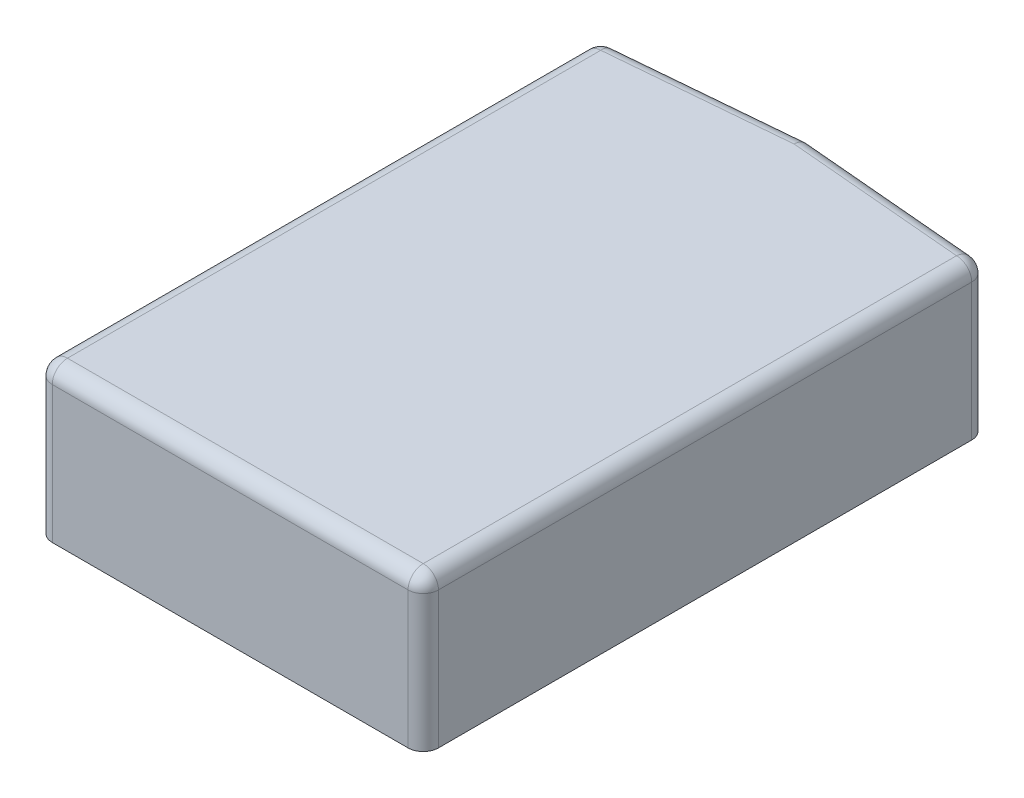
ISO-10303-21;
HEADER;
FILE_DESCRIPTION(('STEP AP214'),'2;1');
FILE_NAME('part.step','',(''),(''),'','','');
FILE_SCHEMA(('AUTOMOTIVE_DESIGN { 1 0 10303 214 1 1 1 1 }'));
ENDSEC;
DATA;
#1=APPLICATION_CONTEXT('core data for automotive mechanical design processes');
#2=APPLICATION_PROTOCOL_DEFINITION('international standard','automotive_design',2000,#1);
#3=PRODUCT_CONTEXT('',#1,'mechanical');
#4=PRODUCT('Part','Part','',(#3));
#5=PRODUCT_RELATED_PRODUCT_CATEGORY('part','',(#4));
#6=PRODUCT_DEFINITION_FORMATION('','',#4);
#7=PRODUCT_DEFINITION_CONTEXT('part definition',#1,'design');
#8=PRODUCT_DEFINITION('design','',#6,#7);
#9=PRODUCT_DEFINITION_SHAPE('','',#8);
#10=(LENGTH_UNIT() NAMED_UNIT(*) SI_UNIT(.MILLI.,.METRE.));
#11=(NAMED_UNIT(*) PLANE_ANGLE_UNIT() SI_UNIT($,.RADIAN.));
#12=(NAMED_UNIT(*) SI_UNIT($,.STERADIAN.) SOLID_ANGLE_UNIT());
#13=UNCERTAINTY_MEASURE_WITH_UNIT(LENGTH_MEASURE(1.E-05),#10,'distance_accuracy_value','');
#14=(GEOMETRIC_REPRESENTATION_CONTEXT(3) GLOBAL_UNCERTAINTY_ASSIGNED_CONTEXT((#13)) GLOBAL_UNIT_ASSIGNED_CONTEXT((#10,
#11,#12)) REPRESENTATION_CONTEXT('',''));
#15=CARTESIAN_POINT('',(0.,0.,0.));
#16=DIRECTION('',(0.,0.,1.));
#17=DIRECTION('',(1.,0.,0.));
#18=AXIS2_PLACEMENT_3D('',#15,#16,#17);
#19=CARTESIAN_POINT('',(-25.4,20.,38.1));
#20=DIRECTION('',(-1.,0.,0.));
#21=DIRECTION('',(0.,0.,1.));
#22=AXIS2_PLACEMENT_3D('',#19,#20,#21);
#23=PLANE('',#22);
#24=DIRECTION('',(0.,0.,-1.));
#25=VECTOR('',#24,1.);
#26=CARTESIAN_POINT('',(-25.4,18.,-35.8777879464415));
#27=LINE('',#26,#25);
#28=CARTESIAN_POINT('',(-25.4,18.,36.1));
#29=VERTEX_POINT('',#28);
#30=CARTESIAN_POINT('',(-25.4,18.,-34.0451255984067));
#31=VERTEX_POINT('',#30);
#32=EDGE_CURVE('E181',#29,#31,#27,.T.);
#33=ORIENTED_EDGE('',*,*,#32,.T.);
#34=DIRECTION('',(0.,1.,0.));
#35=VECTOR('',#34,1.);
#36=CARTESIAN_POINT('',(-25.4,20.,-34.0451255984067));
#37=LINE('',#36,#35);
#38=CARTESIAN_POINT('',(-25.4,0.,-34.0451255984066));
#39=VERTEX_POINT('',#38);
#40=EDGE_CURVE('E60',#31,#39,#37,.F.);
#41=ORIENTED_EDGE('',*,*,#40,.T.);
#42=DIRECTION('',(0.,0.,-1.));
#43=VECTOR('',#42,1.);
#44=CARTESIAN_POINT('',(-25.4,0.,38.1));
#45=LINE('',#44,#43);
#46=CARTESIAN_POINT('',(-25.4,0.,36.1));
#47=VERTEX_POINT('',#46);
#48=EDGE_CURVE('E273',#47,#39,#45,.T.);
#49=ORIENTED_EDGE('',*,*,#48,.F.);
#50=DIRECTION('',(0.,-1.,0.));
#51=VECTOR('',#50,1.);
#52=CARTESIAN_POINT('',(-25.4,18.,36.1));
#53=LINE('',#52,#51);
#54=EDGE_CURVE('E225',#47,#29,#53,.F.);
#55=ORIENTED_EDGE('',*,*,#54,.T.);
#56=EDGE_LOOP('',(#33,#41,#49,#55));
#57=FACE_BOUND('',#56,.T.);
#58=ADVANCED_FACE('F37',(#57),#23,.T.);
#59=CARTESIAN_POINT('',(-25.4,20.,38.1));
#60=DIRECTION('',(0.,0.,-1.));
#61=DIRECTION('',(-1.,0.,0.));
#62=AXIS2_PLACEMENT_3D('',#59,#60,#61);
#63=PLANE('',#62);
#64=DIRECTION('',(1.,0.,0.));
#65=VECTOR('',#64,1.);
#66=CARTESIAN_POINT('',(-25.4,18.,38.1));
#67=LINE('',#66,#65);
#68=CARTESIAN_POINT('',(23.4,18.,38.1));
#69=VERTEX_POINT('',#68);
#70=CARTESIAN_POINT('',(-23.4,18.,38.1));
#71=VERTEX_POINT('',#70);
#72=EDGE_CURVE('E178',#69,#71,#67,.F.);
#73=ORIENTED_EDGE('',*,*,#72,.T.);
#74=DIRECTION('',(0.,-1.,0.));
#75=VECTOR('',#74,1.);
#76=CARTESIAN_POINT('',(-23.4,0.,38.1));
#77=LINE('',#76,#75);
#78=CARTESIAN_POINT('',(-23.4,0.,38.1));
#79=VERTEX_POINT('',#78);
#80=EDGE_CURVE('E221',#71,#79,#77,.T.);
#81=ORIENTED_EDGE('',*,*,#80,.T.);
#82=DIRECTION('',(1.,0.,0.));
#83=VECTOR('',#82,1.);
#84=CARTESIAN_POINT('',(-25.4,0.,38.1));
#85=LINE('',#84,#83);
#86=CARTESIAN_POINT('',(23.4,0.,38.1));
#87=VERTEX_POINT('',#86);
#88=EDGE_CURVE('E149',#79,#87,#85,.T.);
#89=ORIENTED_EDGE('',*,*,#88,.T.);
#90=DIRECTION('',(0.,-1.,0.));
#91=VECTOR('',#90,1.);
#92=CARTESIAN_POINT('',(23.4,20.,38.1));
#93=LINE('',#92,#91);
#94=EDGE_CURVE('E212',#87,#69,#93,.F.);
#95=ORIENTED_EDGE('',*,*,#94,.T.);
#96=EDGE_LOOP('',(#73,#81,#89,#95));
#97=FACE_BOUND('',#96,.T.);
#98=ADVANCED_FACE('F300',(#97),#63,.F.);
#99=CARTESIAN_POINT('',(25.4,20.,38.1));
#100=DIRECTION('',(-1.,0.,0.));
#101=DIRECTION('',(0.,0.,1.));
#102=AXIS2_PLACEMENT_3D('',#99,#100,#101);
#103=PLANE('',#102);
#104=DIRECTION('',(0.,0.,-1.));
#105=VECTOR('',#104,1.);
#106=CARTESIAN_POINT('',(25.4,18.,38.1));
#107=LINE('',#106,#105);
#108=CARTESIAN_POINT('',(25.4,18.,-34.0451255984067));
#109=VERTEX_POINT('',#108);
#110=CARTESIAN_POINT('',(25.4,18.,36.1));
#111=VERTEX_POINT('',#110);
#112=EDGE_CURVE('E175',#109,#111,#107,.F.);
#113=ORIENTED_EDGE('',*,*,#112,.T.);
#114=DIRECTION('',(0.,-1.,0.));
#115=VECTOR('',#114,1.);
#116=CARTESIAN_POINT('',(25.4,20.,36.1));
#117=LINE('',#116,#115);
#118=CARTESIAN_POINT('',(25.4,0.,36.1));
#119=VERTEX_POINT('',#118);
#120=EDGE_CURVE('E207',#111,#119,#117,.T.);
#121=ORIENTED_EDGE('',*,*,#120,.T.);
#122=DIRECTION('',(0.,0.,-1.));
#123=VECTOR('',#122,1.);
#124=CARTESIAN_POINT('',(25.4,0.,38.1));
#125=LINE('',#124,#123);
#126=CARTESIAN_POINT('',(25.4,0.,-34.0451255984066));
#127=VERTEX_POINT('',#126);
#128=EDGE_CURVE('E151',#119,#127,#125,.T.);
#129=ORIENTED_EDGE('',*,*,#128,.T.);
#130=DIRECTION('',(0.,1.,0.));
#131=VECTOR('',#130,1.);
#132=CARTESIAN_POINT('',(25.4,18.,-34.0451255984067));
#133=LINE('',#132,#131);
#134=EDGE_CURVE('E194',#127,#109,#133,.T.);
#135=ORIENTED_EDGE('',*,*,#134,.T.);
#136=EDGE_LOOP('',(#113,#121,#129,#135));
#137=FACE_BOUND('',#136,.T.);
#138=ADVANCED_FACE('F269',(#137),#103,.F.);
#139=CARTESIAN_POINT('',(0.,20.,0.));
#140=DIRECTION('',(0.,-1.,0.));
#141=DIRECTION('',(0.,0.,-1.));
#142=AXIS2_PLACEMENT_3D('',#139,#140,#141);
#143=PLANE('',#142);
#144=DIRECTION('',(1.,0.,0.));
#145=VECTOR('',#144,1.);
#146=CARTESIAN_POINT('',(0.,20.,36.1));
#147=LINE('',#146,#145);
#148=CARTESIAN_POINT('',(-23.4,20.,36.1));
#149=VERTEX_POINT('',#148);
#150=CARTESIAN_POINT('',(23.4,20.,36.1));
#151=VERTEX_POINT('',#150);
#152=EDGE_CURVE('E169',#149,#151,#147,.T.);
#153=ORIENTED_EDGE('',*,*,#152,.T.);
#154=DIRECTION('',(0.,0.,-1.));
#155=VECTOR('',#154,1.);
#156=CARTESIAN_POINT('',(23.4,20.,0.));
#157=LINE('',#156,#155);
#158=CARTESIAN_POINT('',(23.4,20.,-34.0451255984067));
#159=VERTEX_POINT('',#158);
#160=EDGE_CURVE('E172',#151,#159,#157,.T.);
#161=ORIENTED_EDGE('',*,*,#160,.T.);
#162=DIRECTION('',(-0.996194698091746,0.,-0.0871557427476549));
#163=VECTOR('',#162,1.);
#164=CARTESIAN_POINT('',(-0.174311485496365,20.,-36.1076106038165));
#165=LINE('',#164,#163);
#166=CARTESIAN_POINT('',(0.,20.,-36.0923603249132));
#167=VERTEX_POINT('',#166);
#168=EDGE_CURVE('E131',#159,#167,#165,.T.);
#169=ORIENTED_EDGE('',*,*,#168,.T.);
#170=DIRECTION('',(0.996194698091746,0.,-0.0871557427476549));
#171=VECTOR('',#170,1.);
#172=CARTESIAN_POINT('',(-25.2256885145047,20.,-33.885398550258));
#173=LINE('',#172,#171);
#174=CARTESIAN_POINT('',(-23.4,20.,-34.0451255984067));
#175=VERTEX_POINT('',#174);
#176=EDGE_CURVE('E163',#167,#175,#173,.F.);
#177=ORIENTED_EDGE('',*,*,#176,.T.);
#178=DIRECTION('',(0.,0.,-1.));
#179=VECTOR('',#178,1.);
#180=CARTESIAN_POINT('',(-23.4,20.,38.1));
#181=LINE('',#180,#179);
#182=EDGE_CURVE('E166',#175,#149,#181,.F.);
#183=ORIENTED_EDGE('',*,*,#182,.T.);
#184=EDGE_LOOP('',(#153,#161,#169,#177,#183));
#185=FACE_BOUND('',#184,.T.);
#186=ADVANCED_FACE('F250',(#185),#143,.F.);
#187=CARTESIAN_POINT('',(0.,0.,0.));
#188=DIRECTION('',(0.,-1.,0.));
#189=DIRECTION('',(0.,0.,-1.));
#190=AXIS2_PLACEMENT_3D('',#187,#188,#189);
#191=PLANE('',#190);
#192=ORIENTED_EDGE('',*,*,#48,.T.);
#193=CARTESIAN_POINT('',(-23.4,0.,-34.0451255984067));
#194=DIRECTION('',(0.,-1.,0.));
#195=DIRECTION('',(0.,0.,-1.));
#196=AXIS2_PLACEMENT_3D('',#193,#194,#195);
#197=CIRCLE('',#196,2.);
#198=CARTESIAN_POINT('',(-23.5743114854953,0.,-36.0375149945902));
#199=VERTEX_POINT('',#198);
#200=EDGE_CURVE('E46',#39,#199,#197,.T.);
#201=ORIENTED_EDGE('',*,*,#200,.T.);
#202=DIRECTION('',(-0.996194698091746,0.,0.0871557427476549));
#203=VECTOR('',#202,1.);
#204=CARTESIAN_POINT('',(-3.30799778455489,0.,-37.8105876948825));
#205=LINE('',#204,#203);
#206=CARTESIAN_POINT('',(-1.0547118733939E-12,0.,-38.1));
#207=VERTEX_POINT('',#206);
#208=EDGE_CURVE('E122',#199,#207,#205,.F.);
#209=ORIENTED_EDGE('',*,*,#208,.T.);
#210=DIRECTION('',(0.996194698091746,0.,0.0871557427476549));
#211=VECTOR('',#210,1.);
#212=CARTESIAN_POINT('',(3.30799778455489,0.,-37.8105876948825));
#213=LINE('',#212,#211);
#214=CARTESIAN_POINT('',(23.5743114854953,0.,-36.0375149945902));
#215=VERTEX_POINT('',#214);
#216=EDGE_CURVE('E127',#207,#215,#213,.T.);
#217=ORIENTED_EDGE('',*,*,#216,.T.);
#218=CARTESIAN_POINT('',(23.4,0.,-34.0451255984067));
#219=DIRECTION('',(0.,-1.,0.));
#220=DIRECTION('',(0.,0.,-1.));
#221=AXIS2_PLACEMENT_3D('',#218,#219,#220);
#222=CIRCLE('',#221,2.);
#223=EDGE_CURVE('E197',#215,#127,#222,.T.);
#224=ORIENTED_EDGE('',*,*,#223,.T.);
#225=ORIENTED_EDGE('',*,*,#128,.F.);
#226=CARTESIAN_POINT('',(23.4,0.,36.1));
#227=DIRECTION('',(0.,-1.,0.));
#228=DIRECTION('',(0.,0.,-1.));
#229=AXIS2_PLACEMENT_3D('',#226,#227,#228);
#230=CIRCLE('',#229,2.);
#231=EDGE_CURVE('E209',#119,#87,#230,.T.);
#232=ORIENTED_EDGE('',*,*,#231,.T.);
#233=ORIENTED_EDGE('',*,*,#88,.F.);
#234=CARTESIAN_POINT('',(-23.4,0.,36.1));
#235=DIRECTION('',(0.,-1.,0.));
#236=DIRECTION('',(0.,0.,-1.));
#237=AXIS2_PLACEMENT_3D('',#234,#235,#236);
#238=CIRCLE('',#237,2.);
#239=EDGE_CURVE('E223',#79,#47,#238,.T.);
#240=ORIENTED_EDGE('',*,*,#239,.T.);
#241=EDGE_LOOP('',(#192,#201,#209,#217,#224,#225,#232,#233,#240));
#242=FACE_BOUND('',#241,.T.);
#243=ADVANCED_FACE('F124',(#242),#191,.T.);
#244=CARTESIAN_POINT('',(15.4,10.,-40.1));
#245=DIRECTION('',(0.,0.,1.));
#246=DIRECTION('',(1.,0.,0.));
#247=AXIS2_PLACEMENT_3D('',#244,#245,#246);
#248=CYLINDRICAL_SURFACE('',#247,3.7);
#249=CARTESIAN_POINT('',(15.4,10.,-40.1));
#250=DIRECTION('',(0.,0.,-1.));
#251=DIRECTION('',(-1.,0.,0.));
#252=AXIS2_PLACEMENT_3D('',#249,#250,#251);
#253=CIRCLE('',#252,3.7);
#254=CARTESIAN_POINT('',(11.7,10.,-40.1));
#255=VERTEX_POINT('',#254);
#256=EDGE_CURVE('E161',#255,#255,#253,.T.);
#257=ORIENTED_EDGE('',*,*,#256,.F.);
#258=EDGE_LOOP('',(#257));
#259=FACE_BOUND('',#258,.T.);
#260=CARTESIAN_POINT('',(15.4,10.,-36.7526745817007));
#261=DIRECTION('',(0.0871557427476549,0.,-0.996194698091746));
#262=DIRECTION('',(0.996194698091746,0.,0.0871557427476549));
#263=AXIS2_PLACEMENT_3D('',#260,#261,#262);
#264=ELLIPSE('',#263,3.71413339891038,3.7);
#265=CARTESIAN_POINT('',(19.1,10.,-36.4289665266548));
#266=VERTEX_POINT('',#265);
#267=EDGE_CURVE('E158',#266,#266,#264,.T.);
#268=ORIENTED_EDGE('',*,*,#267,.T.);
#269=EDGE_LOOP('',(#268));
#270=FACE_BOUND('',#269,.T.);
#271=ADVANCED_FACE('F311',(#259,#270),#248,.T.);
#272=CARTESIAN_POINT('',(15.4,10.,-40.1));
#273=DIRECTION('',(0.,0.,-1.));
#274=DIRECTION('',(-1.,0.,0.));
#275=AXIS2_PLACEMENT_3D('',#272,#273,#274);
#276=PLANE('',#275);
#277=ORIENTED_EDGE('',*,*,#256,.T.);
#278=EDGE_LOOP('',(#277));
#279=FACE_BOUND('',#278,.T.);
#280=ADVANCED_FACE('F286',(#279),#276,.T.);
#281=CARTESIAN_POINT('',(-15.4,10.,-40.1));
#282=DIRECTION('',(0.,0.,1.));
#283=DIRECTION('',(1.,0.,0.));
#284=AXIS2_PLACEMENT_3D('',#281,#282,#283);
#285=CYLINDRICAL_SURFACE('',#284,3.7);
#286=CARTESIAN_POINT('',(-15.4,10.,-40.1));
#287=DIRECTION('',(0.,0.,-1.));
#288=DIRECTION('',(-1.,0.,0.));
#289=AXIS2_PLACEMENT_3D('',#286,#287,#288);
#290=CIRCLE('',#289,3.7);
#291=CARTESIAN_POINT('',(-19.1,10.,-40.1));
#292=VERTEX_POINT('',#291);
#293=EDGE_CURVE('E157',#292,#292,#290,.T.);
#294=ORIENTED_EDGE('',*,*,#293,.F.);
#295=EDGE_LOOP('',(#294));
#296=FACE_BOUND('',#295,.T.);
#297=CARTESIAN_POINT('',(-15.4,10.,-36.7526745817007));
#298=DIRECTION('',(0.0871557427476549,0.,0.996194698091746));
#299=DIRECTION('',(-0.996194698091746,0.,0.0871557427476549));
#300=AXIS2_PLACEMENT_3D('',#297,#298,#299);
#301=ELLIPSE('',#300,3.71413339891038,3.7);
#302=CARTESIAN_POINT('',(-19.1,10.,-36.4289665266548));
#303=VERTEX_POINT('',#302);
#304=EDGE_CURVE('E142',#303,#303,#301,.F.);
#305=ORIENTED_EDGE('',*,*,#304,.T.);
#306=EDGE_LOOP('',(#305));
#307=FACE_BOUND('',#306,.T.);
#308=ADVANCED_FACE('F283',(#296,#307),#285,.T.);
#309=CARTESIAN_POINT('',(-15.4,10.,-40.1));
#310=DIRECTION('',(0.,0.,-1.));
#311=DIRECTION('',(-1.,0.,0.));
#312=AXIS2_PLACEMENT_3D('',#309,#310,#311);
#313=PLANE('',#312);
#314=ORIENTED_EDGE('',*,*,#293,.T.);
#315=EDGE_LOOP('',(#314));
#316=FACE_BOUND('',#315,.T.);
#317=ADVANCED_FACE('F281',(#316),#313,.T.);
#318=CARTESIAN_POINT('',(-1.0547118733939E-12,20.,-38.1));
#319=DIRECTION('',(0.0871557427476549,0.,-0.996194698091746));
#320=DIRECTION('',(0.,1.,0.));
#321=AXIS2_PLACEMENT_3D('',#318,#319,#320);
#322=PLANE('',#321);
#323=DIRECTION('',(-0.996194698091746,0.,-0.0871557427476549));
#324=VECTOR('',#323,1.);
#325=CARTESIAN_POINT('',(25.4,18.,-35.8777879464415));
#326=LINE('',#325,#324);
#327=CARTESIAN_POINT('',(-1.0547118733939E-12,18.,-38.1));
#328=VERTEX_POINT('',#327);
#329=CARTESIAN_POINT('',(23.5743114854953,18.,-36.0375149945902));
#330=VERTEX_POINT('',#329);
#331=EDGE_CURVE('E184',#328,#330,#326,.F.);
#332=ORIENTED_EDGE('',*,*,#331,.T.);
#333=DIRECTION('',(0.,1.,0.));
#334=VECTOR('',#333,1.);
#335=CARTESIAN_POINT('',(23.5743114854953,0.,-36.0375149945902));
#336=LINE('',#335,#334);
#337=EDGE_CURVE('E148',#330,#215,#336,.F.);
#338=ORIENTED_EDGE('',*,*,#337,.T.);
#339=ORIENTED_EDGE('',*,*,#216,.F.);
#340=DIRECTION('',(0.,-1.,0.));
#341=VECTOR('',#340,1.);
#342=CARTESIAN_POINT('',(-1.0547118733939E-12,0.,-38.1));
#343=LINE('',#342,#341);
#344=EDGE_CURVE('E134',#328,#207,#343,.T.);
#345=ORIENTED_EDGE('',*,*,#344,.F.);
#346=EDGE_LOOP('',(#332,#338,#339,#345));
#347=FACE_BOUND('',#346,.T.);
#348=ORIENTED_EDGE('',*,*,#267,.F.);
#349=EDGE_LOOP('',(#348));
#350=FACE_BOUND('',#349,.T.);
#351=ADVANCED_FACE('F145',(#347,#350),#322,.T.);
#352=CARTESIAN_POINT('',(-25.4,20.,-35.8777879464415));
#353=DIRECTION('',(0.0871557427476549,0.,0.996194698091746));
#354=DIRECTION('',(0.,-1.,0.));
#355=AXIS2_PLACEMENT_3D('',#352,#353,#354);
#356=PLANE('',#355);
#357=ORIENTED_EDGE('',*,*,#208,.F.);
#358=DIRECTION('',(0.,-1.,0.));
#359=VECTOR('',#358,1.);
#360=CARTESIAN_POINT('',(-23.5743114854953,20.,-36.0375149945902));
#361=LINE('',#360,#359);
#362=CARTESIAN_POINT('',(-23.5743114854953,18.,-36.0375149945902));
#363=VERTEX_POINT('',#362);
#364=EDGE_CURVE('E11',#199,#363,#361,.F.);
#365=ORIENTED_EDGE('',*,*,#364,.T.);
#366=DIRECTION('',(-0.996194698091746,0.,0.0871557427476549));
#367=VECTOR('',#366,1.);
#368=CARTESIAN_POINT('',(-1.03926199243598E-12,18.,-38.0999999999998));
#369=LINE('',#368,#367);
#370=EDGE_CURVE('E138',#363,#328,#369,.F.);
#371=ORIENTED_EDGE('',*,*,#370,.T.);
#372=ORIENTED_EDGE('',*,*,#344,.T.);
#373=EDGE_LOOP('',(#357,#365,#371,#372));
#374=FACE_BOUND('',#373,.T.);
#375=ORIENTED_EDGE('',*,*,#304,.F.);
#376=EDGE_LOOP('',(#375));
#377=FACE_BOUND('',#376,.T.);
#378=ADVANCED_FACE('F135',(#374,#377),#356,.F.);
#379=CARTESIAN_POINT('',(-23.4,18.,38.1));
#380=DIRECTION('',(0.,0.,1.));
#381=DIRECTION('',(1.,0.,0.));
#382=AXIS2_PLACEMENT_3D('',#379,#380,#381);
#383=CYLINDRICAL_SURFACE('',#382,2.);
#384=ORIENTED_EDGE('',*,*,#182,.F.);
#385=CARTESIAN_POINT('',(-23.4,18.,-34.0451255984067));
#386=DIRECTION('',(0.,0.,1.));
#387=DIRECTION('',(1.,0.,0.));
#388=AXIS2_PLACEMENT_3D('',#385,#386,#387);
#389=CIRCLE('',#388,2.);
#390=EDGE_CURVE('E231',#175,#31,#389,.T.);
#391=ORIENTED_EDGE('',*,*,#390,.T.);
#392=ORIENTED_EDGE('',*,*,#32,.F.);
#393=CARTESIAN_POINT('',(-23.4,18.,36.1));
#394=DIRECTION('',(0.,0.,1.));
#395=DIRECTION('',(1.,0.,0.));
#396=AXIS2_PLACEMENT_3D('',#393,#394,#395);
#397=CIRCLE('',#396,2.);
#398=EDGE_CURVE('E219',#29,#149,#397,.F.);
#399=ORIENTED_EDGE('',*,*,#398,.T.);
#400=EDGE_LOOP('',(#384,#391,#392,#399));
#401=FACE_BOUND('',#400,.T.);
#402=ADVANCED_FACE('F237',(#401),#383,.T.);
#403=CARTESIAN_POINT('',(-3.13368629905958,18.,-35.818198298699));
#404=DIRECTION('',(-0.996194698091746,0.,0.0871557427476549));
#405=DIRECTION('',(0.0871557427476549,0.,0.996194698091746));
#406=AXIS2_PLACEMENT_3D('',#403,#404,#405);
#407=CYLINDRICAL_SURFACE('',#406,2.);
#408=ORIENTED_EDGE('',*,*,#370,.F.);
#409=CARTESIAN_POINT('',(-23.4,18.,-34.0451255984067));
#410=DIRECTION('',(-0.996194698091746,0.,0.0871557427476549));
#411=DIRECTION('',(0.0871557427476549,0.,0.996194698091746));
#412=AXIS2_PLACEMENT_3D('',#409,#410,#411);
#413=CIRCLE('',#412,2.);
#414=EDGE_CURVE('E227',#363,#175,#413,.F.);
#415=ORIENTED_EDGE('',*,*,#414,.T.);
#416=ORIENTED_EDGE('',*,*,#176,.F.);
#417=CARTESIAN_POINT('',(0.,18.,-36.0923603249132));
#418=DIRECTION('',(1.,0.,0.));
#419=DIRECTION('',(0.,0.,1.));
#420=AXIS2_PLACEMENT_3D('',#417,#418,#419);
#421=ELLIPSE('',#420,2.00763967508669,2.);
#422=EDGE_CURVE('E143',#328,#167,#421,.T.);
#423=ORIENTED_EDGE('',*,*,#422,.F.);
#424=EDGE_LOOP('',(#408,#415,#416,#423));
#425=FACE_BOUND('',#424,.T.);
#426=ADVANCED_FACE('F248',(#425),#407,.T.);
#427=CARTESIAN_POINT('',(0.,18.,36.1));
#428=DIRECTION('',(1.,0.,0.));
#429=DIRECTION('',(0.,0.,-1.));
#430=AXIS2_PLACEMENT_3D('',#427,#428,#429);
#431=CYLINDRICAL_SURFACE('',#430,2.);
#432=ORIENTED_EDGE('',*,*,#152,.F.);
#433=CARTESIAN_POINT('',(-23.4,18.,36.1));
#434=DIRECTION('',(1.,0.,0.));
#435=DIRECTION('',(0.,0.,-1.));
#436=AXIS2_PLACEMENT_3D('',#433,#434,#435);
#437=CIRCLE('',#436,2.);
#438=EDGE_CURVE('E214',#149,#71,#437,.T.);
#439=ORIENTED_EDGE('',*,*,#438,.T.);
#440=ORIENTED_EDGE('',*,*,#72,.F.);
#441=CARTESIAN_POINT('',(23.4,18.,36.1));
#442=DIRECTION('',(1.,0.,0.));
#443=DIRECTION('',(0.,0.,-1.));
#444=AXIS2_PLACEMENT_3D('',#441,#442,#443);
#445=CIRCLE('',#444,2.);
#446=EDGE_CURVE('E205',#69,#151,#445,.F.);
#447=ORIENTED_EDGE('',*,*,#446,.T.);
#448=EDGE_LOOP('',(#432,#439,#440,#447));
#449=FACE_BOUND('',#448,.T.);
#450=ADVANCED_FACE('F343',(#449),#431,.T.);
#451=CARTESIAN_POINT('',(3.13368629905958,18.,-35.818198298699));
#452=DIRECTION('',(0.996194698091746,0.,0.0871557427476549));
#453=DIRECTION('',(0.0871557427476549,0.,-0.996194698091746));
#454=AXIS2_PLACEMENT_3D('',#451,#452,#453);
#455=CYLINDRICAL_SURFACE('',#454,2.);
#456=ORIENTED_EDGE('',*,*,#168,.F.);
#457=CARTESIAN_POINT('',(23.4,18.,-34.0451255984067));
#458=DIRECTION('',(0.996194698091746,0.,0.0871557427476549));
#459=DIRECTION('',(0.0871557427476549,0.,-0.996194698091746));
#460=AXIS2_PLACEMENT_3D('',#457,#458,#459);
#461=CIRCLE('',#460,2.);
#462=EDGE_CURVE('E192',#159,#330,#461,.F.);
#463=ORIENTED_EDGE('',*,*,#462,.T.);
#464=ORIENTED_EDGE('',*,*,#331,.F.);
#465=ORIENTED_EDGE('',*,*,#422,.T.);
#466=EDGE_LOOP('',(#456,#463,#464,#465));
#467=FACE_BOUND('',#466,.T.);
#468=ADVANCED_FACE('F255',(#467),#455,.T.);
#469=CARTESIAN_POINT('',(23.4,18.,0.));
#470=DIRECTION('',(0.,0.,-1.));
#471=DIRECTION('',(-1.,0.,0.));
#472=AXIS2_PLACEMENT_3D('',#469,#470,#471);
#473=CYLINDRICAL_SURFACE('',#472,2.);
#474=ORIENTED_EDGE('',*,*,#160,.F.);
#475=CARTESIAN_POINT('',(23.4,18.,36.1));
#476=DIRECTION('',(0.,0.,-1.));
#477=DIRECTION('',(-1.,0.,0.));
#478=AXIS2_PLACEMENT_3D('',#475,#476,#477);
#479=CIRCLE('',#478,2.);
#480=EDGE_CURVE('E199',#151,#111,#479,.T.);
#481=ORIENTED_EDGE('',*,*,#480,.T.);
#482=ORIENTED_EDGE('',*,*,#112,.F.);
#483=CARTESIAN_POINT('',(23.4,18.,-34.0451255984067));
#484=DIRECTION('',(0.,0.,-1.));
#485=DIRECTION('',(-1.,0.,0.));
#486=AXIS2_PLACEMENT_3D('',#483,#484,#485);
#487=CIRCLE('',#486,2.);
#488=EDGE_CURVE('E186',#109,#159,#487,.F.);
#489=ORIENTED_EDGE('',*,*,#488,.T.);
#490=EDGE_LOOP('',(#474,#481,#482,#489));
#491=FACE_BOUND('',#490,.T.);
#492=ADVANCED_FACE('F266',(#491),#473,.T.);
#493=CARTESIAN_POINT('',(23.4,20.,-34.0451255984067));
#494=DIRECTION('',(0.,-1.,0.));
#495=DIRECTION('',(0.,0.,-1.));
#496=AXIS2_PLACEMENT_3D('',#493,#494,#495);
#497=CYLINDRICAL_SURFACE('',#496,2.);
#498=ORIENTED_EDGE('',*,*,#223,.F.);
#499=ORIENTED_EDGE('',*,*,#337,.F.);
#500=CARTESIAN_POINT('',(23.4,18.,-34.0451255984067));
#501=DIRECTION('',(0.,1.,0.));
#502=DIRECTION('',(0.,0.,1.));
#503=AXIS2_PLACEMENT_3D('',#500,#501,#502);
#504=CIRCLE('',#503,2.);
#505=EDGE_CURVE('E189',#109,#330,#504,.T.);
#506=ORIENTED_EDGE('',*,*,#505,.F.);
#507=ORIENTED_EDGE('',*,*,#134,.F.);
#508=EDGE_LOOP('',(#498,#499,#506,#507));
#509=FACE_BOUND('',#508,.T.);
#510=ADVANCED_FACE('F259',(#509),#497,.T.);
#511=CARTESIAN_POINT('',(23.4,18.,-34.0451255984067));
#512=DIRECTION('',(0.,0.,1.));
#513=DIRECTION('',(1.,0.,0.));
#514=AXIS2_PLACEMENT_3D('',#511,#512,#513);
#515=SPHERICAL_SURFACE('',#514,2.);
#516=ORIENTED_EDGE('',*,*,#505,.T.);
#517=ORIENTED_EDGE('',*,*,#462,.F.);
#518=ORIENTED_EDGE('',*,*,#488,.F.);
#519=EDGE_LOOP('',(#516,#517,#518));
#520=FACE_BOUND('',#519,.T.);
#521=ADVANCED_FACE('F263',(#520),#515,.T.);
#522=CARTESIAN_POINT('',(23.4,20.,36.1));
#523=DIRECTION('',(0.,-1.,0.));
#524=DIRECTION('',(0.,0.,-1.));
#525=AXIS2_PLACEMENT_3D('',#522,#523,#524);
#526=CYLINDRICAL_SURFACE('',#525,2.);
#527=ORIENTED_EDGE('',*,*,#231,.F.);
#528=ORIENTED_EDGE('',*,*,#120,.F.);
#529=CARTESIAN_POINT('',(23.4,18.,36.1));
#530=DIRECTION('',(0.,1.,0.));
#531=DIRECTION('',(0.,0.,1.));
#532=AXIS2_PLACEMENT_3D('',#529,#530,#531);
#533=CIRCLE('',#532,2.);
#534=EDGE_CURVE('E202',#69,#111,#533,.T.);
#535=ORIENTED_EDGE('',*,*,#534,.F.);
#536=ORIENTED_EDGE('',*,*,#94,.F.);
#537=EDGE_LOOP('',(#527,#528,#535,#536));
#538=FACE_BOUND('',#537,.T.);
#539=ADVANCED_FACE('F364',(#538),#526,.T.);
#540=CARTESIAN_POINT('',(23.4,18.,36.1));
#541=DIRECTION('',(0.,0.,1.));
#542=DIRECTION('',(1.,0.,0.));
#543=AXIS2_PLACEMENT_3D('',#540,#541,#542);
#544=SPHERICAL_SURFACE('',#543,2.);
#545=ORIENTED_EDGE('',*,*,#480,.F.);
#546=ORIENTED_EDGE('',*,*,#446,.F.);
#547=ORIENTED_EDGE('',*,*,#534,.T.);
#548=EDGE_LOOP('',(#545,#546,#547));
#549=FACE_BOUND('',#548,.T.);
#550=ADVANCED_FACE('F388',(#549),#544,.T.);
#551=CARTESIAN_POINT('',(-23.4,20.,36.1));
#552=DIRECTION('',(0.,1.,0.));
#553=DIRECTION('',(0.,0.,1.));
#554=AXIS2_PLACEMENT_3D('',#551,#552,#553);
#555=CYLINDRICAL_SURFACE('',#554,2.);
#556=ORIENTED_EDGE('',*,*,#239,.F.);
#557=ORIENTED_EDGE('',*,*,#80,.F.);
#558=CARTESIAN_POINT('',(-23.4,18.,36.1));
#559=DIRECTION('',(0.,1.,0.));
#560=DIRECTION('',(0.,0.,1.));
#561=AXIS2_PLACEMENT_3D('',#558,#559,#560);
#562=CIRCLE('',#561,2.);
#563=EDGE_CURVE('E216',#29,#71,#562,.T.);
#564=ORIENTED_EDGE('',*,*,#563,.F.);
#565=ORIENTED_EDGE('',*,*,#54,.F.);
#566=EDGE_LOOP('',(#556,#557,#564,#565));
#567=FACE_BOUND('',#566,.T.);
#568=ADVANCED_FACE('F398',(#567),#555,.T.);
#569=CARTESIAN_POINT('',(-23.4,18.,36.1));
#570=DIRECTION('',(0.,0.,1.));
#571=DIRECTION('',(1.,0.,0.));
#572=AXIS2_PLACEMENT_3D('',#569,#570,#571);
#573=SPHERICAL_SURFACE('',#572,2.);
#574=ORIENTED_EDGE('',*,*,#438,.F.);
#575=ORIENTED_EDGE('',*,*,#398,.F.);
#576=ORIENTED_EDGE('',*,*,#563,.T.);
#577=EDGE_LOOP('',(#574,#575,#576));
#578=FACE_BOUND('',#577,.T.);
#579=ADVANCED_FACE('F424',(#578),#573,.T.);
#580=CARTESIAN_POINT('',(-23.4,20.,-34.0451255984067));
#581=DIRECTION('',(0.,1.,0.));
#582=DIRECTION('',(0.,0.,1.));
#583=AXIS2_PLACEMENT_3D('',#580,#581,#582);
#584=CYLINDRICAL_SURFACE('',#583,2.);
#585=ORIENTED_EDGE('',*,*,#200,.F.);
#586=ORIENTED_EDGE('',*,*,#40,.F.);
#587=CARTESIAN_POINT('',(-23.4,18.,-34.0451255984067));
#588=DIRECTION('',(0.,1.,0.));
#589=DIRECTION('',(0.,0.,1.));
#590=AXIS2_PLACEMENT_3D('',#587,#588,#589);
#591=CIRCLE('',#590,2.);
#592=EDGE_CURVE('E41',#363,#31,#591,.T.);
#593=ORIENTED_EDGE('',*,*,#592,.F.);
#594=ORIENTED_EDGE('',*,*,#364,.F.);
#595=EDGE_LOOP('',(#585,#586,#593,#594));
#596=FACE_BOUND('',#595,.T.);
#597=ADVANCED_FACE('F39',(#596),#584,.T.);
#598=CARTESIAN_POINT('',(-23.4,18.,-34.0451255984067));
#599=DIRECTION('',(0.,0.,1.));
#600=DIRECTION('',(1.,0.,0.));
#601=AXIS2_PLACEMENT_3D('',#598,#599,#600);
#602=SPHERICAL_SURFACE('',#601,2.);
#603=ORIENTED_EDGE('',*,*,#592,.T.);
#604=ORIENTED_EDGE('',*,*,#390,.F.);
#605=ORIENTED_EDGE('',*,*,#414,.F.);
#606=EDGE_LOOP('',(#603,#604,#605));
#607=FACE_BOUND('',#606,.T.);
#608=ADVANCED_FACE('F245',(#607),#602,.T.);
#609=CLOSED_SHELL('',(#58,#98,#138,#186,#243,#271,#280,#308,#317,#351,#378,#402,#426,#450,#468,
#492,#510,#521,#539,#550,#568,#579,#597,#608));
#610=MANIFOLD_SOLID_BREP('B2',#609);
#611=ADVANCED_BREP_SHAPE_REPRESENTATION('',(#18,#610),#14);
#612=SHAPE_DEFINITION_REPRESENTATION(#9,#611);
ENDSEC;
END-ISO-10303-21;
